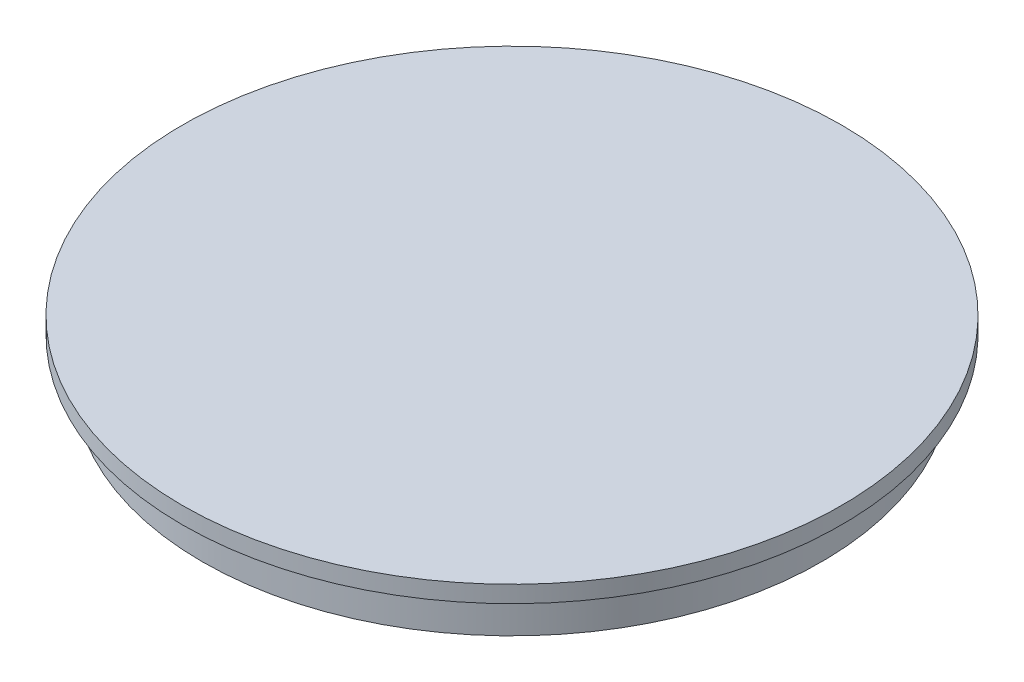
ISO-10303-21;
HEADER;
FILE_DESCRIPTION(('STEP AP214'),'2;1');
FILE_NAME('part.step','',(''),(''),'','','');
FILE_SCHEMA(('AUTOMOTIVE_DESIGN { 1 0 10303 214 1 1 1 1 }'));
ENDSEC;
DATA;
#1=APPLICATION_CONTEXT('core data for automotive mechanical design processes');
#2=APPLICATION_PROTOCOL_DEFINITION('international standard','automotive_design',2000,#1);
#3=PRODUCT_CONTEXT('',#1,'mechanical');
#4=PRODUCT('Part','Part','',(#3));
#5=PRODUCT_RELATED_PRODUCT_CATEGORY('part','',(#4));
#6=PRODUCT_DEFINITION_FORMATION('','',#4);
#7=PRODUCT_DEFINITION_CONTEXT('part definition',#1,'design');
#8=PRODUCT_DEFINITION('design','',#6,#7);
#9=PRODUCT_DEFINITION_SHAPE('','',#8);
#10=(LENGTH_UNIT() NAMED_UNIT(*) SI_UNIT(.MILLI.,.METRE.));
#11=(NAMED_UNIT(*) PLANE_ANGLE_UNIT() SI_UNIT($,.RADIAN.));
#12=(NAMED_UNIT(*) SI_UNIT($,.STERADIAN.) SOLID_ANGLE_UNIT());
#13=UNCERTAINTY_MEASURE_WITH_UNIT(LENGTH_MEASURE(1.E-05),#10,'distance_accuracy_value','');
#14=(GEOMETRIC_REPRESENTATION_CONTEXT(3) GLOBAL_UNCERTAINTY_ASSIGNED_CONTEXT((#13)) GLOBAL_UNIT_ASSIGNED_CONTEXT((#10,
#11,#12)) REPRESENTATION_CONTEXT('',''));
#15=CARTESIAN_POINT('',(0.,0.,0.));
#16=DIRECTION('',(0.,0.,1.));
#17=DIRECTION('',(1.,0.,0.));
#18=AXIS2_PLACEMENT_3D('',#15,#16,#17);
#19=CARTESIAN_POINT('',(0.,10.,0.));
#20=DIRECTION('',(0.,-1.,0.));
#21=DIRECTION('',(0.,0.,-1.));
#22=AXIS2_PLACEMENT_3D('',#19,#20,#21);
#23=CYLINDRICAL_SURFACE('',#22,73.75);
#24=CARTESIAN_POINT('',(0.,10.,0.));
#25=DIRECTION('',(0.,1.,0.));
#26=DIRECTION('',(0.,0.,1.));
#27=AXIS2_PLACEMENT_3D('',#24,#25,#26);
#28=CIRCLE('',#27,73.75);
#29=CARTESIAN_POINT('',(0.,10.,73.75));
#30=VERTEX_POINT('',#29);
#31=EDGE_CURVE('E10',#30,#30,#28,.T.);
#32=ORIENTED_EDGE('',*,*,#31,.F.);
#33=EDGE_LOOP('',(#32));
#34=FACE_BOUND('',#33,.T.);
#35=CARTESIAN_POINT('',(0.,0.,0.));
#36=DIRECTION('',(0.,1.,0.));
#37=DIRECTION('',(0.,0.,1.));
#38=AXIS2_PLACEMENT_3D('',#35,#36,#37);
#39=CIRCLE('',#38,73.75);
#40=CARTESIAN_POINT('',(0.,0.,73.75));
#41=VERTEX_POINT('',#40);
#42=EDGE_CURVE('E40',#41,#41,#39,.T.);
#43=ORIENTED_EDGE('',*,*,#42,.T.);
#44=EDGE_LOOP('',(#43));
#45=FACE_BOUND('',#44,.T.);
#46=ADVANCED_FACE('F37',(#34,#45),#23,.T.);
#47=CARTESIAN_POINT('',(0.,0.,0.));
#48=DIRECTION('',(0.,1.,0.));
#49=DIRECTION('',(0.,0.,1.));
#50=AXIS2_PLACEMENT_3D('',#47,#48,#49);
#51=PLANE('',#50);
#52=ORIENTED_EDGE('',*,*,#42,.F.);
#53=EDGE_LOOP('',(#52));
#54=FACE_BOUND('',#53,.T.);
#55=ADVANCED_FACE('F64',(#54),#51,.F.);
#56=CARTESIAN_POINT('',(0.,14.,0.));
#57=DIRECTION('',(0.,-1.,0.));
#58=DIRECTION('',(0.,0.,-1.));
#59=AXIS2_PLACEMENT_3D('',#56,#57,#58);
#60=CYLINDRICAL_SURFACE('',#59,78.5);
#61=CARTESIAN_POINT('',(0.,14.,0.));
#62=DIRECTION('',(0.,1.,0.));
#63=DIRECTION('',(0.,0.,1.));
#64=AXIS2_PLACEMENT_3D('',#61,#62,#63);
#65=CIRCLE('',#64,78.5);
#66=CARTESIAN_POINT('',(0.,14.,78.5));
#67=VERTEX_POINT('',#66);
#68=EDGE_CURVE('E49',#67,#67,#65,.T.);
#69=ORIENTED_EDGE('',*,*,#68,.F.);
#70=EDGE_LOOP('',(#69));
#71=FACE_BOUND('',#70,.T.);
#72=CARTESIAN_POINT('',(0.,10.,0.));
#73=DIRECTION('',(0.,1.,0.));
#74=DIRECTION('',(0.,0.,1.));
#75=AXIS2_PLACEMENT_3D('',#72,#73,#74);
#76=CIRCLE('',#75,78.5);
#77=CARTESIAN_POINT('',(0.,10.,78.5));
#78=VERTEX_POINT('',#77);
#79=EDGE_CURVE('E51',#78,#78,#76,.T.);
#80=ORIENTED_EDGE('',*,*,#79,.T.);
#81=EDGE_LOOP('',(#80));
#82=FACE_BOUND('',#81,.T.);
#83=ADVANCED_FACE('F61',(#71,#82),#60,.T.);
#84=CARTESIAN_POINT('',(0.,14.,0.));
#85=DIRECTION('',(0.,1.,0.));
#86=DIRECTION('',(0.,0.,1.));
#87=AXIS2_PLACEMENT_3D('',#84,#85,#86);
#88=PLANE('',#87);
#89=ORIENTED_EDGE('',*,*,#68,.T.);
#90=EDGE_LOOP('',(#89));
#91=FACE_BOUND('',#90,.T.);
#92=ADVANCED_FACE('F59',(#91),#88,.T.);
#93=CARTESIAN_POINT('',(0.,10.,0.));
#94=DIRECTION('',(0.,1.,0.));
#95=DIRECTION('',(0.,0.,1.));
#96=AXIS2_PLACEMENT_3D('',#93,#94,#95);
#97=PLANE('',#96);
#98=ORIENTED_EDGE('',*,*,#31,.T.);
#99=EDGE_LOOP('',(#98));
#100=FACE_BOUND('',#99,.T.);
#101=ORIENTED_EDGE('',*,*,#79,.F.);
#102=EDGE_LOOP('',(#101));
#103=FACE_BOUND('',#102,.T.);
#104=ADVANCED_FACE('F68',(#100,#103),#97,.F.);
#105=CLOSED_SHELL('',(#46,#55,#83,#92,#104));
#106=MANIFOLD_SOLID_BREP('B2',#105);
#107=ADVANCED_BREP_SHAPE_REPRESENTATION('',(#18,#106),#14);
#108=SHAPE_DEFINITION_REPRESENTATION(#9,#107);
ENDSEC;
END-ISO-10303-21;
